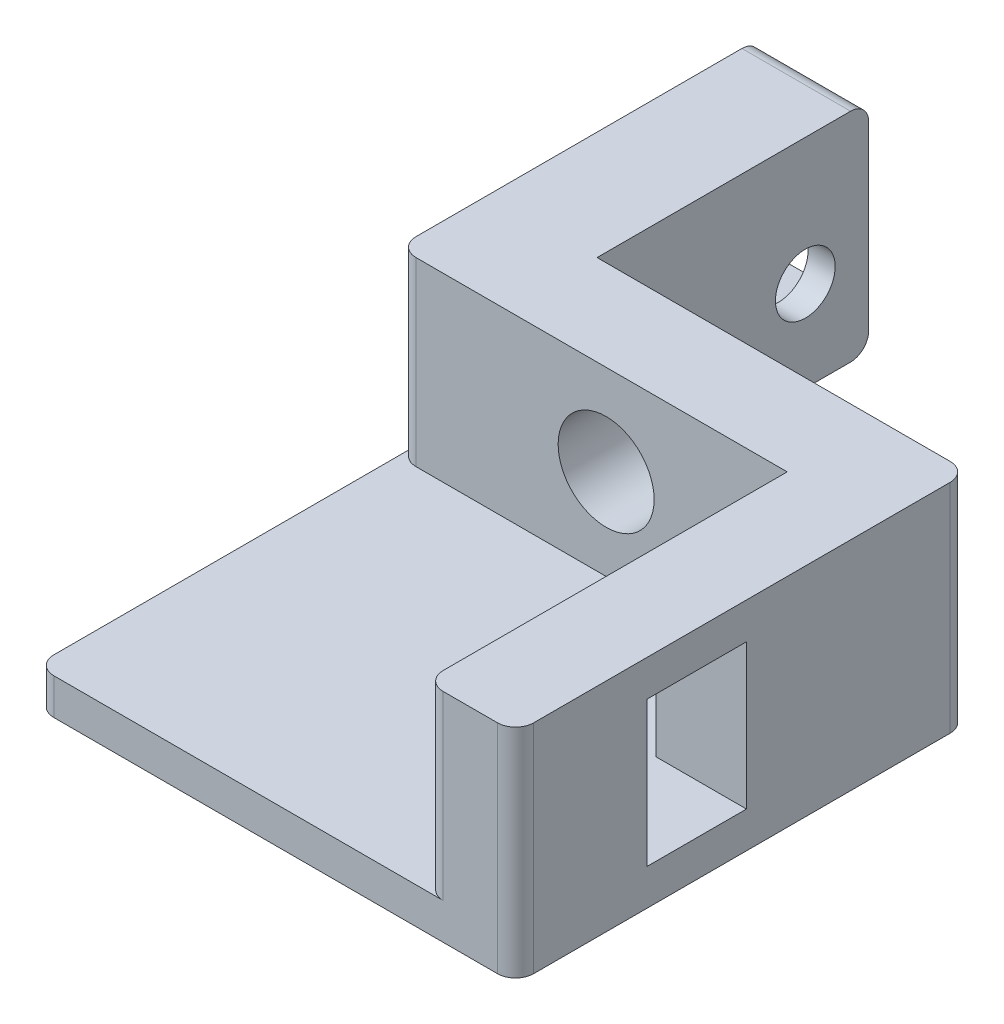
ISO-10303-21;
HEADER;
FILE_DESCRIPTION(('STEP AP214'),'2;1');
FILE_NAME('part.step','',(''),(''),'','','');
FILE_SCHEMA(('AUTOMOTIVE_DESIGN { 1 0 10303 214 1 1 1 1 }'));
ENDSEC;
DATA;
#1=APPLICATION_CONTEXT('core data for automotive mechanical design processes');
#2=APPLICATION_PROTOCOL_DEFINITION('international standard','automotive_design',2000,#1);
#3=PRODUCT_CONTEXT('',#1,'mechanical');
#4=PRODUCT('Part','Part','',(#3));
#5=PRODUCT_RELATED_PRODUCT_CATEGORY('part','',(#4));
#6=PRODUCT_DEFINITION_FORMATION('','',#4);
#7=PRODUCT_DEFINITION_CONTEXT('part definition',#1,'design');
#8=PRODUCT_DEFINITION('design','',#6,#7);
#9=PRODUCT_DEFINITION_SHAPE('','',#8);
#10=(LENGTH_UNIT() NAMED_UNIT(*) SI_UNIT(.MILLI.,.METRE.));
#11=(NAMED_UNIT(*) PLANE_ANGLE_UNIT() SI_UNIT($,.RADIAN.));
#12=(NAMED_UNIT(*) SI_UNIT($,.STERADIAN.) SOLID_ANGLE_UNIT());
#13=UNCERTAINTY_MEASURE_WITH_UNIT(LENGTH_MEASURE(1.E-05),#10,'distance_accuracy_value','');
#14=(GEOMETRIC_REPRESENTATION_CONTEXT(3) GLOBAL_UNCERTAINTY_ASSIGNED_CONTEXT((#13)) GLOBAL_UNIT_ASSIGNED_CONTEXT((#10,
#11,#12)) REPRESENTATION_CONTEXT('',''));
#15=CARTESIAN_POINT('',(0.,0.,0.));
#16=DIRECTION('',(0.,0.,1.));
#17=DIRECTION('',(1.,0.,0.));
#18=AXIS2_PLACEMENT_3D('',#15,#16,#17);
#19=CARTESIAN_POINT('',(0.,10.,-20.));
#20=DIRECTION('',(0.,0.,-1.));
#21=DIRECTION('',(-1.,0.,0.));
#22=AXIS2_PLACEMENT_3D('',#19,#20,#21);
#23=PLANE('',#22);
#24=DIRECTION('',(0.,-1.,0.));
#25=VECTOR('',#24,1.);
#26=CARTESIAN_POINT('',(6.,10.,-20.));
#27=LINE('',#26,#25);
#28=CARTESIAN_POINT('',(6.,9.,-20.));
#29=VERTEX_POINT('',#28);
#30=CARTESIAN_POINT('',(6.,-0.999999999999999,-20.));
#31=VERTEX_POINT('',#30);
#32=EDGE_CURVE('E335',#29,#31,#27,.T.);
#33=ORIENTED_EDGE('',*,*,#32,.T.);
#34=DIRECTION('',(1.,0.,0.));
#35=VECTOR('',#34,1.);
#36=CARTESIAN_POINT('',(0.,-0.999999999999999,-20.));
#37=LINE('',#36,#35);
#38=CARTESIAN_POINT('',(0.,-0.999999999999999,-20.));
#39=VERTEX_POINT('',#38);
#40=EDGE_CURVE('E407',#31,#39,#37,.F.);
#41=ORIENTED_EDGE('',*,*,#40,.T.);
#42=DIRECTION('',(0.,-1.,0.));
#43=VECTOR('',#42,1.);
#44=CARTESIAN_POINT('',(0.,10.,-20.));
#45=LINE('',#44,#43);
#46=CARTESIAN_POINT('',(0.,9.,-20.));
#47=VERTEX_POINT('',#46);
#48=EDGE_CURVE('E323',#47,#39,#45,.T.);
#49=ORIENTED_EDGE('',*,*,#48,.F.);
#50=DIRECTION('',(1.,0.,0.));
#51=VECTOR('',#50,1.);
#52=CARTESIAN_POINT('',(6.,9.,-20.));
#53=LINE('',#52,#51);
#54=EDGE_CURVE('E405',#47,#29,#53,.T.);
#55=ORIENTED_EDGE('',*,*,#54,.T.);
#56=EDGE_LOOP('',(#33,#41,#49,#55));
#57=FACE_BOUND('',#56,.T.);
#58=DIRECTION('',(-1.,0.,0.));
#59=VECTOR('',#58,1.);
#60=CARTESIAN_POINT('',(4.5,0.,-20.));
#61=LINE('',#60,#59);
#62=CARTESIAN_POINT('',(4.5,0.,-20.));
#63=VERTEX_POINT('',#62);
#64=CARTESIAN_POINT('',(1.5,0.,-20.));
#65=VERTEX_POINT('',#64);
#66=EDGE_CURVE('E244',#63,#65,#61,.T.);
#67=ORIENTED_EDGE('',*,*,#66,.F.);
#68=DIRECTION('',(0.,1.,0.));
#69=VECTOR('',#68,1.);
#70=CARTESIAN_POINT('',(4.5,0.,-20.));
#71=LINE('',#70,#69);
#72=CARTESIAN_POINT('',(4.5,6.,-20.));
#73=VERTEX_POINT('',#72);
#74=EDGE_CURVE('E214',#63,#73,#71,.T.);
#75=ORIENTED_EDGE('',*,*,#74,.T.);
#76=DIRECTION('',(-1.,0.,0.));
#77=VECTOR('',#76,1.);
#78=CARTESIAN_POINT('',(4.5,6.,-20.));
#79=LINE('',#78,#77);
#80=CARTESIAN_POINT('',(1.5,6.,-20.));
#81=VERTEX_POINT('',#80);
#82=EDGE_CURVE('E247',#73,#81,#79,.T.);
#83=ORIENTED_EDGE('',*,*,#82,.T.);
#84=DIRECTION('',(0.,1.,0.));
#85=VECTOR('',#84,1.);
#86=CARTESIAN_POINT('',(1.5,0.,-20.));
#87=LINE('',#86,#85);
#88=EDGE_CURVE('E229',#65,#81,#87,.T.);
#89=ORIENTED_EDGE('',*,*,#88,.F.);
#90=EDGE_LOOP('',(#67,#75,#83,#89));
#91=FACE_BOUND('',#90,.T.);
#92=ADVANCED_FACE('F34',(#57,#91),#23,.T.);
#93=CARTESIAN_POINT('',(-4.,3.,-16.5));
#94=DIRECTION('',(1.,0.,0.));
#95=DIRECTION('',(0.,0.,-1.));
#96=AXIS2_PLACEMENT_3D('',#93,#94,#95);
#97=CYLINDRICAL_SURFACE('',#96,1.65);
#98=CARTESIAN_POINT('',(6.,3.,-16.5));
#99=DIRECTION('',(1.,0.,0.));
#100=DIRECTION('',(0.,0.,-1.));
#101=AXIS2_PLACEMENT_3D('',#98,#99,#100);
#102=CIRCLE('',#101,1.65);
#103=CARTESIAN_POINT('',(6.,3.,-18.15));
#104=VERTEX_POINT('',#103);
#105=EDGE_CURVE('E261',#104,#104,#102,.T.);
#106=ORIENTED_EDGE('',*,*,#105,.T.);
#107=EDGE_LOOP('',(#106));
#108=FACE_BOUND('',#107,.T.);
#109=CARTESIAN_POINT('',(4.5,3.,-16.5));
#110=DIRECTION('',(-1.,0.,0.));
#111=DIRECTION('',(0.,0.,1.));
#112=AXIS2_PLACEMENT_3D('',#109,#110,#111);
#113=CIRCLE('',#112,1.65);
#114=CARTESIAN_POINT('',(4.5,3.,-14.85));
#115=VERTEX_POINT('',#114);
#116=EDGE_CURVE('E258',#115,#115,#113,.F.);
#117=ORIENTED_EDGE('',*,*,#116,.F.);
#118=EDGE_LOOP('',(#117));
#119=FACE_BOUND('',#118,.T.);
#120=ADVANCED_FACE('F506',(#108,#119),#97,.F.);
#121=CARTESIAN_POINT('',(21.5,10.,0.));
#122=DIRECTION('',(0.,0.,1.));
#123=DIRECTION('',(1.,0.,0.));
#124=AXIS2_PLACEMENT_3D('',#121,#122,#123);
#125=PLANE('',#124);
#126=CARTESIAN_POINT('',(11.5,5.,0.));
#127=DIRECTION('',(0.,0.,1.));
#128=DIRECTION('',(1.,0.,0.));
#129=AXIS2_PLACEMENT_3D('',#126,#127,#128);
#130=CIRCLE('',#129,2.65);
#131=CARTESIAN_POINT('',(14.15,5.,0.));
#132=VERTEX_POINT('',#131);
#133=EDGE_CURVE('E257',#132,#132,#130,.T.);
#134=ORIENTED_EDGE('',*,*,#133,.F.);
#135=EDGE_LOOP('',(#134));
#136=FACE_BOUND('',#135,.T.);
#137=DIRECTION('',(-1.,0.,0.));
#138=VECTOR('',#137,1.);
#139=CARTESIAN_POINT('',(21.5,10.,0.));
#140=LINE('',#139,#138);
#141=CARTESIAN_POINT('',(21.5,10.,0.));
#142=VERTEX_POINT('',#141);
#143=CARTESIAN_POINT('',(1.,10.,0.));
#144=VERTEX_POINT('',#143);
#145=EDGE_CURVE('E303',#142,#144,#140,.T.);
#146=ORIENTED_EDGE('',*,*,#145,.T.);
#147=DIRECTION('',(0.,-1.,0.));
#148=VECTOR('',#147,1.);
#149=CARTESIAN_POINT('',(1.,10.,0.));
#150=LINE('',#149,#148);
#151=CARTESIAN_POINT('',(1.,0.,0.));
#152=VERTEX_POINT('',#151);
#153=EDGE_CURVE('E400',#144,#152,#150,.T.);
#154=ORIENTED_EDGE('',*,*,#153,.T.);
#155=DIRECTION('',(-1.,0.,0.));
#156=VECTOR('',#155,1.);
#157=CARTESIAN_POINT('',(21.5,0.,0.));
#158=LINE('',#157,#156);
#159=CARTESIAN_POINT('',(21.5,0.,0.));
#160=VERTEX_POINT('',#159);
#161=EDGE_CURVE('E299',#160,#152,#158,.T.);
#162=ORIENTED_EDGE('',*,*,#161,.F.);
#163=DIRECTION('',(0.,-1.,0.));
#164=VECTOR('',#163,1.);
#165=CARTESIAN_POINT('',(21.5,10.,0.));
#166=LINE('',#165,#164);
#167=EDGE_CURVE('E328',#142,#160,#166,.T.);
#168=ORIENTED_EDGE('',*,*,#167,.F.);
#169=EDGE_LOOP('',(#146,#154,#162,#168));
#170=FACE_BOUND('',#169,.T.);
#171=ADVANCED_FACE('F479',(#136,#170),#125,.T.);
#172=CARTESIAN_POINT('',(21.5,10.,20.));
#173=DIRECTION('',(-1.,0.,0.));
#174=DIRECTION('',(0.,0.,1.));
#175=AXIS2_PLACEMENT_3D('',#172,#173,#174);
#176=PLANE('',#175);
#177=DIRECTION('',(0.,0.,-1.));
#178=VECTOR('',#177,1.);
#179=CARTESIAN_POINT('',(21.5,0.,20.));
#180=LINE('',#179,#178);
#181=CARTESIAN_POINT('',(21.5,0.,19.));
#182=VERTEX_POINT('',#181);
#183=CARTESIAN_POINT('',(21.5,0.,12.75));
#184=VERTEX_POINT('',#183);
#185=EDGE_CURVE('E307',#182,#184,#180,.T.);
#186=ORIENTED_EDGE('',*,*,#185,.F.);
#187=DIRECTION('',(0.,-1.,0.));
#188=VECTOR('',#187,1.);
#189=CARTESIAN_POINT('',(21.5,10.,19.));
#190=LINE('',#189,#188);
#191=CARTESIAN_POINT('',(21.5,10.,19.));
#192=VERTEX_POINT('',#191);
#193=EDGE_CURVE('E380',#182,#192,#190,.F.);
#194=ORIENTED_EDGE('',*,*,#193,.T.);
#195=DIRECTION('',(0.,0.,-1.));
#196=VECTOR('',#195,1.);
#197=CARTESIAN_POINT('',(21.5,10.,20.));
#198=LINE('',#197,#196);
#199=EDGE_CURVE('E321',#192,#142,#198,.T.);
#200=ORIENTED_EDGE('',*,*,#199,.T.);
#201=ORIENTED_EDGE('',*,*,#167,.T.);
#202=CARTESIAN_POINT('',(21.5,0.,7.25));
#203=VERTEX_POINT('',#202);
#204=EDGE_CURVE('E326',#203,#160,#180,.T.);
#205=ORIENTED_EDGE('',*,*,#204,.F.);
#206=DIRECTION('',(0.,-1.,0.));
#207=VECTOR('',#206,1.);
#208=CARTESIAN_POINT('',(21.5,0.,7.25000000000001));
#209=LINE('',#208,#207);
#210=CARTESIAN_POINT('',(21.5,8.,7.25));
#211=VERTEX_POINT('',#210);
#212=EDGE_CURVE('E265',#211,#203,#209,.T.);
#213=ORIENTED_EDGE('',*,*,#212,.F.);
#214=DIRECTION('',(0.,0.,-1.));
#215=VECTOR('',#214,1.);
#216=CARTESIAN_POINT('',(21.5,8.,7.25));
#217=LINE('',#216,#215);
#218=CARTESIAN_POINT('',(21.5,8.,12.75));
#219=VERTEX_POINT('',#218);
#220=EDGE_CURVE('E270',#219,#211,#217,.T.);
#221=ORIENTED_EDGE('',*,*,#220,.F.);
#222=DIRECTION('',(0.,1.,0.));
#223=VECTOR('',#222,1.);
#224=CARTESIAN_POINT('',(21.5,0.,12.75));
#225=LINE('',#224,#223);
#226=EDGE_CURVE('E267',#184,#219,#225,.T.);
#227=ORIENTED_EDGE('',*,*,#226,.F.);
#228=EDGE_LOOP('',(#186,#194,#200,#201,#205,#213,#221,#227));
#229=FACE_BOUND('',#228,.T.);
#230=ADVANCED_FACE('F418',(#229),#176,.T.);
#231=CARTESIAN_POINT('',(26.5,10.,20.));
#232=DIRECTION('',(0.,0.,1.));
#233=DIRECTION('',(1.,0.,0.));
#234=AXIS2_PLACEMENT_3D('',#231,#232,#233);
#235=PLANE('',#234);
#236=DIRECTION('',(-1.,0.,0.));
#237=VECTOR('',#236,1.);
#238=CARTESIAN_POINT('',(26.5,0.,20.));
#239=LINE('',#238,#237);
#240=CARTESIAN_POINT('',(22.5,0.,20.));
#241=VERTEX_POINT('',#240);
#242=CARTESIAN_POINT('',(1.,0.,20.));
#243=VERTEX_POINT('',#242);
#244=EDGE_CURVE('E276',#241,#243,#239,.T.);
#245=ORIENTED_EDGE('',*,*,#244,.T.);
#246=DIRECTION('',(0.,1.,0.));
#247=VECTOR('',#246,1.);
#248=CARTESIAN_POINT('',(1.,10.,20.));
#249=LINE('',#248,#247);
#250=CARTESIAN_POINT('',(1.,-2.,20.));
#251=VERTEX_POINT('',#250);
#252=EDGE_CURVE('E369',#243,#251,#249,.F.);
#253=ORIENTED_EDGE('',*,*,#252,.T.);
#254=DIRECTION('',(-1.,0.,0.));
#255=VECTOR('',#254,1.);
#256=CARTESIAN_POINT('',(26.5,-2.,20.));
#257=LINE('',#256,#255);
#258=CARTESIAN_POINT('',(25.5,-2.,20.));
#259=VERTEX_POINT('',#258);
#260=EDGE_CURVE('E287',#259,#251,#257,.T.);
#261=ORIENTED_EDGE('',*,*,#260,.F.);
#262=DIRECTION('',(0.,-1.,0.));
#263=VECTOR('',#262,1.);
#264=CARTESIAN_POINT('',(25.5,10.,20.));
#265=LINE('',#264,#263);
#266=CARTESIAN_POINT('',(25.5,10.,20.));
#267=VERTEX_POINT('',#266);
#268=EDGE_CURVE('E364',#259,#267,#265,.F.);
#269=ORIENTED_EDGE('',*,*,#268,.T.);
#270=DIRECTION('',(-1.,0.,0.));
#271=VECTOR('',#270,1.);
#272=CARTESIAN_POINT('',(26.5,10.,20.));
#273=LINE('',#272,#271);
#274=CARTESIAN_POINT('',(22.5,10.,20.));
#275=VERTEX_POINT('',#274);
#276=EDGE_CURVE('E318',#267,#275,#273,.T.);
#277=ORIENTED_EDGE('',*,*,#276,.T.);
#278=DIRECTION('',(0.,-1.,0.));
#279=VECTOR('',#278,1.);
#280=CARTESIAN_POINT('',(22.5,10.,20.));
#281=LINE('',#280,#279);
#282=EDGE_CURVE('E366',#275,#241,#281,.T.);
#283=ORIENTED_EDGE('',*,*,#282,.T.);
#284=EDGE_LOOP('',(#245,#253,#261,#269,#277,#283));
#285=FACE_BOUND('',#284,.T.);
#286=ADVANCED_FACE('F429',(#285),#235,.T.);
#287=CARTESIAN_POINT('',(26.5,10.,-5.));
#288=DIRECTION('',(1.,0.,0.));
#289=DIRECTION('',(0.,0.,-1.));
#290=AXIS2_PLACEMENT_3D('',#287,#288,#289);
#291=PLANE('',#290);
#292=DIRECTION('',(0.,1.,0.));
#293=VECTOR('',#292,1.);
#294=CARTESIAN_POINT('',(26.5,10.,7.25));
#295=LINE('',#294,#293);
#296=CARTESIAN_POINT('',(26.5,0.,7.25000000000001));
#297=VERTEX_POINT('',#296);
#298=CARTESIAN_POINT('',(26.5,8.,7.25));
#299=VERTEX_POINT('',#298);
#300=EDGE_CURVE('E345',#297,#299,#295,.T.);
#301=ORIENTED_EDGE('',*,*,#300,.F.);
#302=DIRECTION('',(0.,0.,-1.));
#303=VECTOR('',#302,1.);
#304=CARTESIAN_POINT('',(26.5,0.,-5.));
#305=LINE('',#304,#303);
#306=CARTESIAN_POINT('',(26.5,0.,12.75));
#307=VERTEX_POINT('',#306);
#308=EDGE_CURVE('E331',#307,#297,#305,.T.);
#309=ORIENTED_EDGE('',*,*,#308,.F.);
#310=DIRECTION('',(0.,-1.,0.));
#311=VECTOR('',#310,1.);
#312=CARTESIAN_POINT('',(26.5,10.,12.75));
#313=LINE('',#312,#311);
#314=CARTESIAN_POINT('',(26.5,8.,12.75));
#315=VERTEX_POINT('',#314);
#316=EDGE_CURVE('E340',#315,#307,#313,.T.);
#317=ORIENTED_EDGE('',*,*,#316,.F.);
#318=DIRECTION('',(0.,0.,1.));
#319=VECTOR('',#318,1.);
#320=CARTESIAN_POINT('',(26.5,8.,-5.));
#321=LINE('',#320,#319);
#322=EDGE_CURVE('E343',#299,#315,#321,.T.);
#323=ORIENTED_EDGE('',*,*,#322,.F.);
#324=EDGE_LOOP('',(#301,#309,#317,#323));
#325=FACE_BOUND('',#324,.T.);
#326=DIRECTION('',(0.,0.,1.));
#327=VECTOR('',#326,1.);
#328=CARTESIAN_POINT('',(26.5,10.,-5.));
#329=LINE('',#328,#327);
#330=CARTESIAN_POINT('',(26.5,10.,-4.));
#331=VERTEX_POINT('',#330);
#332=CARTESIAN_POINT('',(26.5,10.,19.));
#333=VERTEX_POINT('',#332);
#334=EDGE_CURVE('E315',#331,#333,#329,.T.);
#335=ORIENTED_EDGE('',*,*,#334,.T.);
#336=DIRECTION('',(0.,-1.,0.));
#337=VECTOR('',#336,1.);
#338=CARTESIAN_POINT('',(26.5,10.,19.));
#339=LINE('',#338,#337);
#340=CARTESIAN_POINT('',(26.5,-2.,19.));
#341=VERTEX_POINT('',#340);
#342=EDGE_CURVE('E394',#333,#341,#339,.T.);
#343=ORIENTED_EDGE('',*,*,#342,.T.);
#344=DIRECTION('',(0.,0.,1.));
#345=VECTOR('',#344,1.);
#346=CARTESIAN_POINT('',(26.5,-2.,-5.));
#347=LINE('',#346,#345);
#348=CARTESIAN_POINT('',(26.5,-2.,-4.));
#349=VERTEX_POINT('',#348);
#350=EDGE_CURVE('E284',#349,#341,#347,.T.);
#351=ORIENTED_EDGE('',*,*,#350,.F.);
#352=DIRECTION('',(0.,-1.,0.));
#353=VECTOR('',#352,1.);
#354=CARTESIAN_POINT('',(26.5,10.,-4.));
#355=LINE('',#354,#353);
#356=EDGE_CURVE('E392',#349,#331,#355,.F.);
#357=ORIENTED_EDGE('',*,*,#356,.T.);
#358=EDGE_LOOP('',(#335,#343,#351,#357));
#359=FACE_BOUND('',#358,.T.);
#360=ADVANCED_FACE('F438',(#325,#359),#291,.T.);
#361=CARTESIAN_POINT('',(6.,10.,-5.));
#362=DIRECTION('',(0.,0.,-1.));
#363=DIRECTION('',(-1.,0.,0.));
#364=AXIS2_PLACEMENT_3D('',#361,#362,#363);
#365=PLANE('',#364);
#366=CARTESIAN_POINT('',(11.5,5.,-5.));
#367=DIRECTION('',(0.,0.,-1.));
#368=DIRECTION('',(-1.,0.,0.));
#369=AXIS2_PLACEMENT_3D('',#366,#367,#368);
#370=CIRCLE('',#369,2.65);
#371=CARTESIAN_POINT('',(8.85,5.,-5.));
#372=VERTEX_POINT('',#371);
#373=EDGE_CURVE('E254',#372,#372,#370,.T.);
#374=ORIENTED_EDGE('',*,*,#373,.F.);
#375=EDGE_LOOP('',(#374));
#376=FACE_BOUND('',#375,.T.);
#377=DIRECTION('',(1.,0.,0.));
#378=VECTOR('',#377,1.);
#379=CARTESIAN_POINT('',(6.,10.,-5.));
#380=LINE('',#379,#378);
#381=CARTESIAN_POINT('',(6.,10.,-5.));
#382=VERTEX_POINT('',#381);
#383=CARTESIAN_POINT('',(25.5,10.,-5.));
#384=VERTEX_POINT('',#383);
#385=EDGE_CURVE('E312',#382,#384,#380,.T.);
#386=ORIENTED_EDGE('',*,*,#385,.T.);
#387=DIRECTION('',(0.,-1.,0.));
#388=VECTOR('',#387,1.);
#389=CARTESIAN_POINT('',(25.5,10.,-5.));
#390=LINE('',#389,#388);
#391=CARTESIAN_POINT('',(25.5,-2.,-5.));
#392=VERTEX_POINT('',#391);
#393=EDGE_CURVE('E397',#384,#392,#390,.T.);
#394=ORIENTED_EDGE('',*,*,#393,.T.);
#395=DIRECTION('',(1.,0.,0.));
#396=VECTOR('',#395,1.);
#397=CARTESIAN_POINT('',(26.5,-2.,-5.));
#398=LINE('',#397,#396);
#399=CARTESIAN_POINT('',(6.,-2.,-5.));
#400=VERTEX_POINT('',#399);
#401=EDGE_CURVE('E296',#400,#392,#398,.T.);
#402=ORIENTED_EDGE('',*,*,#401,.F.);
#403=DIRECTION('',(0.,-1.,0.));
#404=VECTOR('',#403,1.);
#405=CARTESIAN_POINT('',(6.,10.,-5.));
#406=LINE('',#405,#404);
#407=EDGE_CURVE('E332',#382,#400,#406,.T.);
#408=ORIENTED_EDGE('',*,*,#407,.F.);
#409=EDGE_LOOP('',(#386,#394,#402,#408));
#410=FACE_BOUND('',#409,.T.);
#411=ADVANCED_FACE('F448',(#376,#410),#365,.T.);
#412=CARTESIAN_POINT('',(6.,10.,-20.));
#413=DIRECTION('',(1.,0.,0.));
#414=DIRECTION('',(0.,0.,-1.));
#415=AXIS2_PLACEMENT_3D('',#412,#413,#414);
#416=PLANE('',#415);
#417=ORIENTED_EDGE('',*,*,#105,.F.);
#418=EDGE_LOOP('',(#417));
#419=FACE_BOUND('',#418,.T.);
#420=DIRECTION('',(0.,0.,1.));
#421=VECTOR('',#420,1.);
#422=CARTESIAN_POINT('',(6.,-2.,-20.));
#423=LINE('',#422,#421);
#424=CARTESIAN_POINT('',(6.,-2.,-19.));
#425=VERTEX_POINT('',#424);
#426=EDGE_CURVE('E294',#425,#400,#423,.T.);
#427=ORIENTED_EDGE('',*,*,#426,.F.);
#428=CARTESIAN_POINT('',(6.,-1.,-19.));
#429=DIRECTION('',(1.,0.,0.));
#430=DIRECTION('',(0.,0.,-1.));
#431=AXIS2_PLACEMENT_3D('',#428,#429,#430);
#432=CIRCLE('',#431,1.);
#433=EDGE_CURVE('E49',#425,#31,#432,.T.);
#434=ORIENTED_EDGE('',*,*,#433,.T.);
#435=ORIENTED_EDGE('',*,*,#32,.F.);
#436=CARTESIAN_POINT('',(6.,9.,-19.));
#437=DIRECTION('',(1.,0.,0.));
#438=DIRECTION('',(0.,0.,-1.));
#439=AXIS2_PLACEMENT_3D('',#436,#437,#438);
#440=CIRCLE('',#439,1.);
#441=CARTESIAN_POINT('',(6.,10.,-19.));
#442=VERTEX_POINT('',#441);
#443=EDGE_CURVE('E57',#29,#442,#440,.T.);
#444=ORIENTED_EDGE('',*,*,#443,.T.);
#445=DIRECTION('',(0.,0.,1.));
#446=VECTOR('',#445,1.);
#447=CARTESIAN_POINT('',(6.,10.,-20.));
#448=LINE('',#447,#446);
#449=EDGE_CURVE('E310',#442,#382,#448,.T.);
#450=ORIENTED_EDGE('',*,*,#449,.T.);
#451=ORIENTED_EDGE('',*,*,#407,.T.);
#452=EDGE_LOOP('',(#427,#434,#435,#444,#450,#451));
#453=FACE_BOUND('',#452,.T.);
#454=ADVANCED_FACE('F450',(#419,#453),#416,.T.);
#455=CARTESIAN_POINT('',(0.,10.,0.));
#456=DIRECTION('',(-1.,0.,0.));
#457=DIRECTION('',(0.,0.,1.));
#458=AXIS2_PLACEMENT_3D('',#455,#456,#457);
#459=PLANE('',#458);
#460=CARTESIAN_POINT('',(0.,3.,-16.5));
#461=DIRECTION('',(-1.,0.,0.));
#462=DIRECTION('',(0.,0.,1.));
#463=AXIS2_PLACEMENT_3D('',#460,#461,#462);
#464=CIRCLE('',#463,1.65);
#465=CARTESIAN_POINT('',(0.,3.,-14.85));
#466=VERTEX_POINT('',#465);
#467=EDGE_CURVE('E264',#466,#466,#464,.T.);
#468=ORIENTED_EDGE('',*,*,#467,.F.);
#469=EDGE_LOOP('',(#468));
#470=FACE_BOUND('',#469,.T.);
#471=DIRECTION('',(0.,0.,-1.));
#472=VECTOR('',#471,1.);
#473=CARTESIAN_POINT('',(0.,-2.,-20.));
#474=LINE('',#473,#472);
#475=CARTESIAN_POINT('',(0.,-2.,19.));
#476=VERTEX_POINT('',#475);
#477=CARTESIAN_POINT('',(0.,-2.,-19.));
#478=VERTEX_POINT('',#477);
#479=EDGE_CURVE('E291',#476,#478,#474,.T.);
#480=ORIENTED_EDGE('',*,*,#479,.F.);
#481=DIRECTION('',(0.,1.,0.));
#482=VECTOR('',#481,1.);
#483=CARTESIAN_POINT('',(0.,10.,19.));
#484=LINE('',#483,#482);
#485=CARTESIAN_POINT('',(0.,0.,19.));
#486=VERTEX_POINT('',#485);
#487=EDGE_CURVE('E359',#476,#486,#484,.T.);
#488=ORIENTED_EDGE('',*,*,#487,.T.);
#489=DIRECTION('',(0.,0.,-1.));
#490=VECTOR('',#489,1.);
#491=CARTESIAN_POINT('',(0.,0.,-20.));
#492=LINE('',#491,#490);
#493=CARTESIAN_POINT('',(0.,0.,-1.));
#494=VERTEX_POINT('',#493);
#495=EDGE_CURVE('E288',#486,#494,#492,.T.);
#496=ORIENTED_EDGE('',*,*,#495,.T.);
#497=DIRECTION('',(0.,-1.,0.));
#498=VECTOR('',#497,1.);
#499=CARTESIAN_POINT('',(0.,10.,-1.));
#500=LINE('',#499,#498);
#501=CARTESIAN_POINT('',(0.,10.,-1.));
#502=VERTEX_POINT('',#501);
#503=EDGE_CURVE('E357',#494,#502,#500,.F.);
#504=ORIENTED_EDGE('',*,*,#503,.T.);
#505=DIRECTION('',(0.,0.,-1.));
#506=VECTOR('',#505,1.);
#507=CARTESIAN_POINT('',(0.,10.,0.));
#508=LINE('',#507,#506);
#509=CARTESIAN_POINT('',(0.,10.,-19.));
#510=VERTEX_POINT('',#509);
#511=EDGE_CURVE('E306',#502,#510,#508,.T.);
#512=ORIENTED_EDGE('',*,*,#511,.T.);
#513=CARTESIAN_POINT('',(0.,9.,-19.));
#514=DIRECTION('',(-1.,0.,0.));
#515=DIRECTION('',(0.,0.,1.));
#516=AXIS2_PLACEMENT_3D('',#513,#514,#515);
#517=CIRCLE('',#516,1.);
#518=EDGE_CURVE('E347',#510,#47,#517,.T.);
#519=ORIENTED_EDGE('',*,*,#518,.T.);
#520=ORIENTED_EDGE('',*,*,#48,.T.);
#521=CARTESIAN_POINT('',(0.,-1.,-19.));
#522=DIRECTION('',(-1.,0.,0.));
#523=DIRECTION('',(0.,0.,1.));
#524=AXIS2_PLACEMENT_3D('',#521,#522,#523);
#525=CIRCLE('',#524,1.);
#526=EDGE_CURVE('E355',#39,#478,#525,.T.);
#527=ORIENTED_EDGE('',*,*,#526,.T.);
#528=EDGE_LOOP('',(#480,#488,#496,#504,#512,#519,#520,#527));
#529=FACE_BOUND('',#528,.T.);
#530=ADVANCED_FACE('F456',(#470,#529),#459,.T.);
#531=CARTESIAN_POINT('',(0.,10.,0.));
#532=DIRECTION('',(0.,-1.,0.));
#533=DIRECTION('',(0.,0.,-1.));
#534=AXIS2_PLACEMENT_3D('',#531,#532,#533);
#535=PLANE('',#534);
#536=ORIENTED_EDGE('',*,*,#199,.F.);
#537=CARTESIAN_POINT('',(22.5,10.,19.));
#538=DIRECTION('',(0.,-1.,0.));
#539=DIRECTION('',(0.,0.,-1.));
#540=AXIS2_PLACEMENT_3D('',#537,#538,#539);
#541=CIRCLE('',#540,1.);
#542=EDGE_CURVE('E390',#192,#275,#541,.F.);
#543=ORIENTED_EDGE('',*,*,#542,.T.);
#544=ORIENTED_EDGE('',*,*,#276,.F.);
#545=CARTESIAN_POINT('',(25.5,10.,19.));
#546=DIRECTION('',(0.,-1.,0.));
#547=DIRECTION('',(0.,0.,-1.));
#548=AXIS2_PLACEMENT_3D('',#545,#546,#547);
#549=CIRCLE('',#548,1.);
#550=EDGE_CURVE('E388',#267,#333,#549,.F.);
#551=ORIENTED_EDGE('',*,*,#550,.T.);
#552=ORIENTED_EDGE('',*,*,#334,.F.);
#553=CARTESIAN_POINT('',(25.5,10.,-4.));
#554=DIRECTION('',(0.,-1.,0.));
#555=DIRECTION('',(0.,0.,-1.));
#556=AXIS2_PLACEMENT_3D('',#553,#554,#555);
#557=CIRCLE('',#556,1.);
#558=EDGE_CURVE('E386',#331,#384,#557,.F.);
#559=ORIENTED_EDGE('',*,*,#558,.T.);
#560=ORIENTED_EDGE('',*,*,#385,.F.);
#561=ORIENTED_EDGE('',*,*,#449,.F.);
#562=DIRECTION('',(1.,0.,0.));
#563=VECTOR('',#562,1.);
#564=CARTESIAN_POINT('',(0.,10.,-19.));
#565=LINE('',#564,#563);
#566=EDGE_CURVE('E382',#442,#510,#565,.F.);
#567=ORIENTED_EDGE('',*,*,#566,.T.);
#568=ORIENTED_EDGE('',*,*,#511,.F.);
#569=CARTESIAN_POINT('',(1.,10.,-1.));
#570=DIRECTION('',(0.,-1.,0.));
#571=DIRECTION('',(0.,0.,-1.));
#572=AXIS2_PLACEMENT_3D('',#569,#570,#571);
#573=CIRCLE('',#572,1.);
#574=EDGE_CURVE('E384',#502,#144,#573,.F.);
#575=ORIENTED_EDGE('',*,*,#574,.T.);
#576=ORIENTED_EDGE('',*,*,#145,.F.);
#577=EDGE_LOOP('',(#536,#543,#544,#551,#552,#559,#560,#561,#567,#568,#575,#576));
#578=FACE_BOUND('',#577,.T.);
#579=ADVANCED_FACE('F425',(#578),#535,.F.);
#580=CARTESIAN_POINT('',(0.,0.,0.));
#581=DIRECTION('',(0.,-1.,0.));
#582=DIRECTION('',(0.,0.,-1.));
#583=AXIS2_PLACEMENT_3D('',#580,#581,#582);
#584=PLANE('',#583);
#585=ORIENTED_EDGE('',*,*,#495,.F.);
#586=CARTESIAN_POINT('',(1.,0.,19.));
#587=DIRECTION('',(0.,-1.,0.));
#588=DIRECTION('',(0.,0.,-1.));
#589=AXIS2_PLACEMENT_3D('',#586,#587,#588);
#590=CIRCLE('',#589,1.);
#591=EDGE_CURVE('E362',#486,#243,#590,.F.);
#592=ORIENTED_EDGE('',*,*,#591,.T.);
#593=ORIENTED_EDGE('',*,*,#244,.F.);
#594=CARTESIAN_POINT('',(22.5,0.,19.));
#595=DIRECTION('',(0.,-1.,0.));
#596=DIRECTION('',(0.,0.,-1.));
#597=AXIS2_PLACEMENT_3D('',#594,#595,#596);
#598=CIRCLE('',#597,1.);
#599=EDGE_CURVE('E42',#241,#182,#598,.T.);
#600=ORIENTED_EDGE('',*,*,#599,.T.);
#601=ORIENTED_EDGE('',*,*,#185,.T.);
#602=DIRECTION('',(-1.,0.,0.));
#603=VECTOR('',#602,1.);
#604=CARTESIAN_POINT('',(31.5,0.,12.75));
#605=LINE('',#604,#603);
#606=EDGE_CURVE('E279',#307,#184,#605,.T.);
#607=ORIENTED_EDGE('',*,*,#606,.F.);
#608=ORIENTED_EDGE('',*,*,#308,.T.);
#609=DIRECTION('',(-1.,0.,0.));
#610=VECTOR('',#609,1.);
#611=CARTESIAN_POINT('',(31.5,0.,7.25000000000001));
#612=LINE('',#611,#610);
#613=EDGE_CURVE('E273',#297,#203,#612,.T.);
#614=ORIENTED_EDGE('',*,*,#613,.T.);
#615=ORIENTED_EDGE('',*,*,#204,.T.);
#616=ORIENTED_EDGE('',*,*,#161,.T.);
#617=CARTESIAN_POINT('',(1.,0.,-1.));
#618=DIRECTION('',(0.,-1.,0.));
#619=DIRECTION('',(0.,0.,-1.));
#620=AXIS2_PLACEMENT_3D('',#617,#618,#619);
#621=CIRCLE('',#620,1.);
#622=EDGE_CURVE('E11',#152,#494,#621,.T.);
#623=ORIENTED_EDGE('',*,*,#622,.T.);
#624=EDGE_LOOP('',(#585,#592,#593,#600,#601,#607,#608,#614,#615,#616,#623));
#625=FACE_BOUND('',#624,.T.);
#626=ADVANCED_FACE('F412',(#625),#584,.F.);
#627=CARTESIAN_POINT('',(0.,-2.,0.));
#628=DIRECTION('',(0.,-1.,0.));
#629=DIRECTION('',(0.,0.,-1.));
#630=AXIS2_PLACEMENT_3D('',#627,#628,#629);
#631=PLANE('',#630);
#632=ORIENTED_EDGE('',*,*,#260,.T.);
#633=CARTESIAN_POINT('',(1.,-2.,19.));
#634=DIRECTION('',(0.,-1.,0.));
#635=DIRECTION('',(0.,0.,-1.));
#636=AXIS2_PLACEMENT_3D('',#633,#634,#635);
#637=CIRCLE('',#636,1.);
#638=EDGE_CURVE('E378',#251,#476,#637,.T.);
#639=ORIENTED_EDGE('',*,*,#638,.T.);
#640=ORIENTED_EDGE('',*,*,#479,.T.);
#641=DIRECTION('',(1.,0.,0.));
#642=VECTOR('',#641,1.);
#643=CARTESIAN_POINT('',(0.,-2.,-19.));
#644=LINE('',#643,#642);
#645=EDGE_CURVE('E371',#478,#425,#644,.T.);
#646=ORIENTED_EDGE('',*,*,#645,.T.);
#647=ORIENTED_EDGE('',*,*,#426,.T.);
#648=ORIENTED_EDGE('',*,*,#401,.T.);
#649=CARTESIAN_POINT('',(25.5,-2.,-4.));
#650=DIRECTION('',(0.,-1.,0.));
#651=DIRECTION('',(0.,0.,-1.));
#652=AXIS2_PLACEMENT_3D('',#649,#650,#651);
#653=CIRCLE('',#652,1.);
#654=EDGE_CURVE('E374',#392,#349,#653,.T.);
#655=ORIENTED_EDGE('',*,*,#654,.T.);
#656=ORIENTED_EDGE('',*,*,#350,.T.);
#657=CARTESIAN_POINT('',(25.5,-2.,19.));
#658=DIRECTION('',(0.,-1.,0.));
#659=DIRECTION('',(0.,0.,-1.));
#660=AXIS2_PLACEMENT_3D('',#657,#658,#659);
#661=CIRCLE('',#660,1.);
#662=EDGE_CURVE('E376',#341,#259,#661,.T.);
#663=ORIENTED_EDGE('',*,*,#662,.T.);
#664=EDGE_LOOP('',(#632,#639,#640,#646,#647,#648,#655,#656,#663));
#665=FACE_BOUND('',#664,.T.);
#666=ADVANCED_FACE('F466',(#665),#631,.T.);
#667=CARTESIAN_POINT('',(31.5,0.,7.25000000000001));
#668=DIRECTION('',(0.,0.,-1.));
#669=DIRECTION('',(0.,1.,0.));
#670=AXIS2_PLACEMENT_3D('',#667,#668,#669);
#671=PLANE('',#670);
#672=ORIENTED_EDGE('',*,*,#300,.T.);
#673=DIRECTION('',(-1.,0.,0.));
#674=VECTOR('',#673,1.);
#675=CARTESIAN_POINT('',(31.5,8.,7.25));
#676=LINE('',#675,#674);
#677=EDGE_CURVE('E274',#299,#211,#676,.T.);
#678=ORIENTED_EDGE('',*,*,#677,.T.);
#679=ORIENTED_EDGE('',*,*,#212,.T.);
#680=ORIENTED_EDGE('',*,*,#613,.F.);
#681=EDGE_LOOP('',(#672,#678,#679,#680));
#682=FACE_BOUND('',#681,.T.);
#683=ADVANCED_FACE('F486',(#682),#671,.F.);
#684=CARTESIAN_POINT('',(31.5,8.,7.25));
#685=DIRECTION('',(0.,1.,0.));
#686=DIRECTION('',(0.,0.,1.));
#687=AXIS2_PLACEMENT_3D('',#684,#685,#686);
#688=PLANE('',#687);
#689=ORIENTED_EDGE('',*,*,#322,.T.);
#690=DIRECTION('',(-1.,0.,0.));
#691=VECTOR('',#690,1.);
#692=CARTESIAN_POINT('',(31.5,8.,12.75));
#693=LINE('',#692,#691);
#694=EDGE_CURVE('E277',#315,#219,#693,.T.);
#695=ORIENTED_EDGE('',*,*,#694,.T.);
#696=ORIENTED_EDGE('',*,*,#220,.T.);
#697=ORIENTED_EDGE('',*,*,#677,.F.);
#698=EDGE_LOOP('',(#689,#695,#696,#697));
#699=FACE_BOUND('',#698,.T.);
#700=ADVANCED_FACE('F493',(#699),#688,.F.);
#701=CARTESIAN_POINT('',(31.5,0.,12.75));
#702=DIRECTION('',(0.,0.,1.));
#703=DIRECTION('',(0.,-1.,0.));
#704=AXIS2_PLACEMENT_3D('',#701,#702,#703);
#705=PLANE('',#704);
#706=ORIENTED_EDGE('',*,*,#316,.T.);
#707=ORIENTED_EDGE('',*,*,#606,.T.);
#708=ORIENTED_EDGE('',*,*,#226,.T.);
#709=ORIENTED_EDGE('',*,*,#694,.F.);
#710=EDGE_LOOP('',(#706,#707,#708,#709));
#711=FACE_BOUND('',#710,.T.);
#712=ADVANCED_FACE('F495',(#711),#705,.F.);
#713=CARTESIAN_POINT('',(1.5,3.,-16.5));
#714=DIRECTION('',(-1.,0.,0.));
#715=DIRECTION('',(0.,0.,1.));
#716=AXIS2_PLACEMENT_3D('',#713,#714,#715);
#717=CIRCLE('',#716,1.65);
#718=CARTESIAN_POINT('',(1.5,3.,-14.85));
#719=VERTEX_POINT('',#718);
#720=EDGE_CURVE('E246',#719,#719,#717,.F.);
#721=ORIENTED_EDGE('',*,*,#720,.T.);
#722=EDGE_LOOP('',(#721));
#723=FACE_BOUND('',#722,.T.);
#724=ORIENTED_EDGE('',*,*,#467,.T.);
#725=EDGE_LOOP('',(#724));
#726=FACE_BOUND('',#725,.T.);
#727=ADVANCED_FACE('F497',(#723,#726),#97,.F.);
#728=CARTESIAN_POINT('',(11.5,5.,5.));
#729=DIRECTION('',(0.,0.,-1.));
#730=DIRECTION('',(-1.,0.,0.));
#731=AXIS2_PLACEMENT_3D('',#728,#729,#730);
#732=CYLINDRICAL_SURFACE('',#731,2.65);
#733=ORIENTED_EDGE('',*,*,#133,.T.);
#734=EDGE_LOOP('',(#733));
#735=FACE_BOUND('',#734,.T.);
#736=ORIENTED_EDGE('',*,*,#373,.T.);
#737=EDGE_LOOP('',(#736));
#738=FACE_BOUND('',#737,.T.);
#739=ADVANCED_FACE('F503',(#735,#738),#732,.F.);
#740=CARTESIAN_POINT('',(4.5,0.,0.));
#741=DIRECTION('',(-1.,0.,0.));
#742=DIRECTION('',(0.,0.,1.));
#743=AXIS2_PLACEMENT_3D('',#740,#741,#742);
#744=PLANE('',#743);
#745=DIRECTION('',(0.,0.,1.));
#746=VECTOR('',#745,1.);
#747=CARTESIAN_POINT('',(4.5,0.,-18.2320508075689));
#748=LINE('',#747,#746);
#749=CARTESIAN_POINT('',(4.5,0.,-14.7679491924311));
#750=VERTEX_POINT('',#749);
#751=EDGE_CURVE('E206',#63,#750,#748,.T.);
#752=ORIENTED_EDGE('',*,*,#751,.T.);
#753=DIRECTION('',(0.,0.866025403784439,0.499999999999999));
#754=VECTOR('',#753,1.);
#755=CARTESIAN_POINT('',(4.5,0.,-14.7679491924311));
#756=LINE('',#755,#754);
#757=CARTESIAN_POINT('',(4.5,3.,-13.0358983848622));
#758=VERTEX_POINT('',#757);
#759=EDGE_CURVE('E217',#750,#758,#756,.T.);
#760=ORIENTED_EDGE('',*,*,#759,.T.);
#761=DIRECTION('',(0.,0.866025403784438,-0.5));
#762=VECTOR('',#761,1.);
#763=CARTESIAN_POINT('',(4.5,3.,-13.0358983848622));
#764=LINE('',#763,#762);
#765=CARTESIAN_POINT('',(4.5,6.,-14.7679491924311));
#766=VERTEX_POINT('',#765);
#767=EDGE_CURVE('E222',#758,#766,#764,.T.);
#768=ORIENTED_EDGE('',*,*,#767,.T.);
#769=DIRECTION('',(0.,0.,-1.));
#770=VECTOR('',#769,1.);
#771=CARTESIAN_POINT('',(4.5,6.,-14.7679491924311));
#772=LINE('',#771,#770);
#773=EDGE_CURVE('E233',#766,#73,#772,.T.);
#774=ORIENTED_EDGE('',*,*,#773,.T.);
#775=ORIENTED_EDGE('',*,*,#74,.F.);
#776=EDGE_LOOP('',(#752,#760,#768,#774,#775));
#777=FACE_BOUND('',#776,.T.);
#778=ORIENTED_EDGE('',*,*,#116,.T.);
#779=EDGE_LOOP('',(#778));
#780=FACE_BOUND('',#779,.T.);
#781=ADVANCED_FACE('F224',(#777,#780),#744,.T.);
#782=CARTESIAN_POINT('',(1.5,0.,0.));
#783=DIRECTION('',(-1.,0.,0.));
#784=DIRECTION('',(0.,0.,1.));
#785=AXIS2_PLACEMENT_3D('',#782,#783,#784);
#786=PLANE('',#785);
#787=DIRECTION('',(0.,0.,-1.));
#788=VECTOR('',#787,1.);
#789=CARTESIAN_POINT('',(1.5,0.,-18.2320508075689));
#790=LINE('',#789,#788);
#791=CARTESIAN_POINT('',(1.5,0.,-14.7679491924311));
#792=VERTEX_POINT('',#791);
#793=EDGE_CURVE('E209',#792,#65,#790,.T.);
#794=ORIENTED_EDGE('',*,*,#793,.T.);
#795=ORIENTED_EDGE('',*,*,#88,.T.);
#796=DIRECTION('',(0.,0.,1.));
#797=VECTOR('',#796,1.);
#798=CARTESIAN_POINT('',(1.5,6.,-20.));
#799=LINE('',#798,#797);
#800=CARTESIAN_POINT('',(1.5,6.,-14.7679491924311));
#801=VERTEX_POINT('',#800);
#802=EDGE_CURVE('E241',#81,#801,#799,.T.);
#803=ORIENTED_EDGE('',*,*,#802,.T.);
#804=DIRECTION('',(0.,0.866025403784438,-0.5));
#805=VECTOR('',#804,1.);
#806=CARTESIAN_POINT('',(1.5,3.,-13.0358983848622));
#807=LINE('',#806,#805);
#808=CARTESIAN_POINT('',(1.5,3.,-13.0358983848622));
#809=VERTEX_POINT('',#808);
#810=EDGE_CURVE('E238',#809,#801,#807,.T.);
#811=ORIENTED_EDGE('',*,*,#810,.F.);
#812=DIRECTION('',(0.,0.866025403784439,0.499999999999999));
#813=VECTOR('',#812,1.);
#814=CARTESIAN_POINT('',(1.5,0.,-14.7679491924311));
#815=LINE('',#814,#813);
#816=EDGE_CURVE('E236',#792,#809,#815,.T.);
#817=ORIENTED_EDGE('',*,*,#816,.F.);
#818=EDGE_LOOP('',(#794,#795,#803,#811,#817));
#819=FACE_BOUND('',#818,.T.);
#820=ORIENTED_EDGE('',*,*,#720,.F.);
#821=EDGE_LOOP('',(#820));
#822=FACE_BOUND('',#821,.T.);
#823=ADVANCED_FACE('F701',(#819,#822),#786,.F.);
#824=CARTESIAN_POINT('',(4.5,0.,-18.2320508075689));
#825=DIRECTION('',(0.,1.,0.));
#826=DIRECTION('',(0.,0.,1.));
#827=AXIS2_PLACEMENT_3D('',#824,#825,#826);
#828=PLANE('',#827);
#829=ORIENTED_EDGE('',*,*,#793,.F.);
#830=DIRECTION('',(-1.,0.,0.));
#831=VECTOR('',#830,1.);
#832=CARTESIAN_POINT('',(4.5,0.,-14.7679491924311));
#833=LINE('',#832,#831);
#834=EDGE_CURVE('E202',#750,#792,#833,.T.);
#835=ORIENTED_EDGE('',*,*,#834,.F.);
#836=ORIENTED_EDGE('',*,*,#751,.F.);
#837=ORIENTED_EDGE('',*,*,#66,.T.);
#838=EDGE_LOOP('',(#829,#835,#836,#837));
#839=FACE_BOUND('',#838,.T.);
#840=ADVANCED_FACE('F204',(#839),#828,.T.);
#841=CARTESIAN_POINT('',(4.5,6.,-20.));
#842=DIRECTION('',(0.,-1.,0.));
#843=DIRECTION('',(0.,0.,-1.));
#844=AXIS2_PLACEMENT_3D('',#841,#842,#843);
#845=PLANE('',#844);
#846=ORIENTED_EDGE('',*,*,#802,.F.);
#847=ORIENTED_EDGE('',*,*,#82,.F.);
#848=ORIENTED_EDGE('',*,*,#773,.F.);
#849=DIRECTION('',(-1.,0.,0.));
#850=VECTOR('',#849,1.);
#851=CARTESIAN_POINT('',(4.5,6.,-14.7679491924311));
#852=LINE('',#851,#850);
#853=EDGE_CURVE('E250',#766,#801,#852,.T.);
#854=ORIENTED_EDGE('',*,*,#853,.T.);
#855=EDGE_LOOP('',(#846,#847,#848,#854));
#856=FACE_BOUND('',#855,.T.);
#857=ADVANCED_FACE('F681',(#856),#845,.T.);
#858=CARTESIAN_POINT('',(4.5,3.,-13.0358983848622));
#859=DIRECTION('',(0.,0.5,0.866025403784438));
#860=DIRECTION('',(0.,-0.866025403784438,0.5));
#861=AXIS2_PLACEMENT_3D('',#858,#859,#860);
#862=PLANE('',#861);
#863=ORIENTED_EDGE('',*,*,#810,.T.);
#864=ORIENTED_EDGE('',*,*,#853,.F.);
#865=ORIENTED_EDGE('',*,*,#767,.F.);
#866=DIRECTION('',(-1.,0.,0.));
#867=VECTOR('',#866,1.);
#868=CARTESIAN_POINT('',(4.5,3.,-13.0358983848622));
#869=LINE('',#868,#867);
#870=EDGE_CURVE('E213',#758,#809,#869,.T.);
#871=ORIENTED_EDGE('',*,*,#870,.T.);
#872=EDGE_LOOP('',(#863,#864,#865,#871));
#873=FACE_BOUND('',#872,.T.);
#874=ADVANCED_FACE('F672',(#873),#862,.F.);
#875=CARTESIAN_POINT('',(4.5,0.,-14.7679491924311));
#876=DIRECTION('',(0.,-0.499999999999999,0.866025403784439));
#877=DIRECTION('',(0.,-0.866025403784439,-0.499999999999999));
#878=AXIS2_PLACEMENT_3D('',#875,#876,#877);
#879=PLANE('',#878);
#880=ORIENTED_EDGE('',*,*,#816,.T.);
#881=ORIENTED_EDGE('',*,*,#870,.F.);
#882=ORIENTED_EDGE('',*,*,#759,.F.);
#883=ORIENTED_EDGE('',*,*,#834,.T.);
#884=EDGE_LOOP('',(#880,#881,#882,#883));
#885=FACE_BOUND('',#884,.T.);
#886=ADVANCED_FACE('F218',(#885),#879,.F.);
#887=CARTESIAN_POINT('',(1.,10.,19.));
#888=DIRECTION('',(0.,1.,0.));
#889=DIRECTION('',(0.,0.,1.));
#890=AXIS2_PLACEMENT_3D('',#887,#888,#889);
#891=CYLINDRICAL_SURFACE('',#890,1.);
#892=ORIENTED_EDGE('',*,*,#638,.F.);
#893=ORIENTED_EDGE('',*,*,#252,.F.);
#894=ORIENTED_EDGE('',*,*,#591,.F.);
#895=ORIENTED_EDGE('',*,*,#487,.F.);
#896=EDGE_LOOP('',(#892,#893,#894,#895));
#897=FACE_BOUND('',#896,.T.);
#898=ADVANCED_FACE('F470',(#897),#891,.T.);
#899=CARTESIAN_POINT('',(22.5,10.,19.));
#900=DIRECTION('',(0.,-1.,0.));
#901=DIRECTION('',(0.,0.,-1.));
#902=AXIS2_PLACEMENT_3D('',#899,#900,#901);
#903=CYLINDRICAL_SURFACE('',#902,1.);
#904=ORIENTED_EDGE('',*,*,#542,.F.);
#905=ORIENTED_EDGE('',*,*,#193,.F.);
#906=ORIENTED_EDGE('',*,*,#599,.F.);
#907=ORIENTED_EDGE('',*,*,#282,.F.);
#908=EDGE_LOOP('',(#904,#905,#906,#907));
#909=FACE_BOUND('',#908,.T.);
#910=ADVANCED_FACE('F422',(#909),#903,.T.);
#911=CARTESIAN_POINT('',(25.5,10.,19.));
#912=DIRECTION('',(0.,-1.,0.));
#913=DIRECTION('',(0.,0.,-1.));
#914=AXIS2_PLACEMENT_3D('',#911,#912,#913);
#915=CYLINDRICAL_SURFACE('',#914,1.);
#916=ORIENTED_EDGE('',*,*,#550,.F.);
#917=ORIENTED_EDGE('',*,*,#268,.F.);
#918=ORIENTED_EDGE('',*,*,#662,.F.);
#919=ORIENTED_EDGE('',*,*,#342,.F.);
#920=EDGE_LOOP('',(#916,#917,#918,#919));
#921=FACE_BOUND('',#920,.T.);
#922=ADVANCED_FACE('F433',(#921),#915,.T.);
#923=CARTESIAN_POINT('',(25.5,10.,-4.));
#924=DIRECTION('',(0.,-1.,0.));
#925=DIRECTION('',(0.,0.,-1.));
#926=AXIS2_PLACEMENT_3D('',#923,#924,#925);
#927=CYLINDRICAL_SURFACE('',#926,1.);
#928=ORIENTED_EDGE('',*,*,#558,.F.);
#929=ORIENTED_EDGE('',*,*,#356,.F.);
#930=ORIENTED_EDGE('',*,*,#654,.F.);
#931=ORIENTED_EDGE('',*,*,#393,.F.);
#932=EDGE_LOOP('',(#928,#929,#930,#931));
#933=FACE_BOUND('',#932,.T.);
#934=ADVANCED_FACE('F442',(#933),#927,.T.);
#935=CARTESIAN_POINT('',(1.,10.,-1.));
#936=DIRECTION('',(0.,-1.,0.));
#937=DIRECTION('',(0.,0.,-1.));
#938=AXIS2_PLACEMENT_3D('',#935,#936,#937);
#939=CYLINDRICAL_SURFACE('',#938,1.);
#940=ORIENTED_EDGE('',*,*,#574,.F.);
#941=ORIENTED_EDGE('',*,*,#503,.F.);
#942=ORIENTED_EDGE('',*,*,#622,.F.);
#943=ORIENTED_EDGE('',*,*,#153,.F.);
#944=EDGE_LOOP('',(#940,#941,#942,#943));
#945=FACE_BOUND('',#944,.T.);
#946=ADVANCED_FACE('F476',(#945),#939,.T.);
#947=CARTESIAN_POINT('',(0.,-1.,-19.));
#948=DIRECTION('',(1.,0.,0.));
#949=DIRECTION('',(0.,0.,-1.));
#950=AXIS2_PLACEMENT_3D('',#947,#948,#949);
#951=CYLINDRICAL_SURFACE('',#950,1.);
#952=ORIENTED_EDGE('',*,*,#526,.F.);
#953=ORIENTED_EDGE('',*,*,#40,.F.);
#954=ORIENTED_EDGE('',*,*,#433,.F.);
#955=ORIENTED_EDGE('',*,*,#645,.F.);
#956=EDGE_LOOP('',(#952,#953,#954,#955));
#957=FACE_BOUND('',#956,.T.);
#958=ADVANCED_FACE('F462',(#957),#951,.T.);
#959=CARTESIAN_POINT('',(0.,9.,-19.));
#960=DIRECTION('',(-1.,0.,0.));
#961=DIRECTION('',(0.,0.,1.));
#962=AXIS2_PLACEMENT_3D('',#959,#960,#961);
#963=CYLINDRICAL_SURFACE('',#962,1.);
#964=ORIENTED_EDGE('',*,*,#518,.F.);
#965=ORIENTED_EDGE('',*,*,#566,.F.);
#966=ORIENTED_EDGE('',*,*,#443,.F.);
#967=ORIENTED_EDGE('',*,*,#54,.F.);
#968=EDGE_LOOP('',(#964,#965,#966,#967));
#969=FACE_BOUND('',#968,.T.);
#970=ADVANCED_FACE('F36',(#969),#963,.T.);
#971=CLOSED_SHELL('',(#92,#120,#171,#230,#286,#360,#411,#454,#530,#579,#626,#666,#683,#700,#712,
#727,#739,#781,#823,#840,#857,#874,#886,#898,#910,#922,#934,#946,#958,#970));
#972=MANIFOLD_SOLID_BREP('B2',#971);
#973=ADVANCED_BREP_SHAPE_REPRESENTATION('',(#18,#972),#14);
#974=SHAPE_DEFINITION_REPRESENTATION(#9,#973);
ENDSEC;
END-ISO-10303-21;
